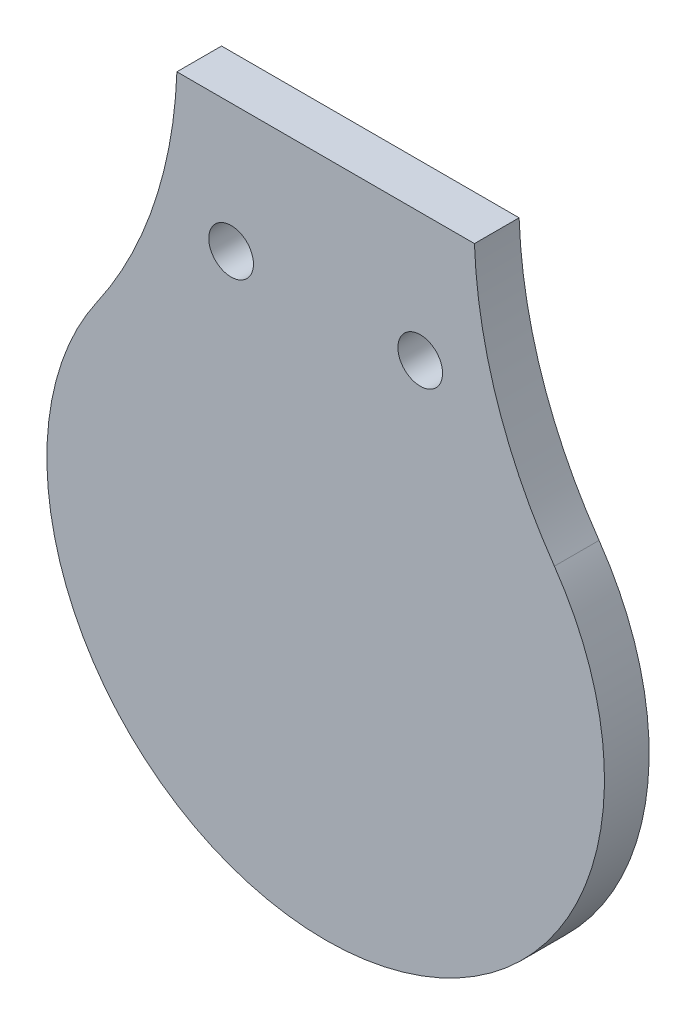
ISO-10303-21;
HEADER;
FILE_DESCRIPTION(('STEP AP214'),'2;1');
FILE_NAME('part.step','',(''),(''),'','','');
FILE_SCHEMA(('AUTOMOTIVE_DESIGN { 1 0 10303 214 1 1 1 1 }'));
ENDSEC;
DATA;
#1=APPLICATION_CONTEXT('core data for automotive mechanical design processes');
#2=APPLICATION_PROTOCOL_DEFINITION('international standard','automotive_design',2000,#1);
#3=PRODUCT_CONTEXT('',#1,'mechanical');
#4=PRODUCT('Part','Part','',(#3));
#5=PRODUCT_RELATED_PRODUCT_CATEGORY('part','',(#4));
#6=PRODUCT_DEFINITION_FORMATION('','',#4);
#7=PRODUCT_DEFINITION_CONTEXT('part definition',#1,'design');
#8=PRODUCT_DEFINITION('design','',#6,#7);
#9=PRODUCT_DEFINITION_SHAPE('','',#8);
#10=(LENGTH_UNIT() NAMED_UNIT(*) SI_UNIT(.MILLI.,.METRE.));
#11=(NAMED_UNIT(*) PLANE_ANGLE_UNIT() SI_UNIT($,.RADIAN.));
#12=(NAMED_UNIT(*) SI_UNIT($,.STERADIAN.) SOLID_ANGLE_UNIT());
#13=UNCERTAINTY_MEASURE_WITH_UNIT(LENGTH_MEASURE(1.E-05),#10,'distance_accuracy_value','');
#14=(GEOMETRIC_REPRESENTATION_CONTEXT(3) GLOBAL_UNCERTAINTY_ASSIGNED_CONTEXT((#13)) GLOBAL_UNIT_ASSIGNED_CONTEXT((#10,
#11,#12)) REPRESENTATION_CONTEXT('',''));
#15=CARTESIAN_POINT('',(0.,0.,0.));
#16=DIRECTION('',(0.,0.,1.));
#17=DIRECTION('',(1.,0.,0.));
#18=AXIS2_PLACEMENT_3D('',#15,#16,#17);
#19=CARTESIAN_POINT('',(67.691,-360.114950628356,5.08));
#20=DIRECTION('',(0.,0.,1.));
#21=DIRECTION('',(1.,0.,0.));
#22=AXIS2_PLACEMENT_3D('',#19,#20,#21);
#23=PLANE('',#22);
#24=CARTESIAN_POINT('',(-10.7564051785917,-376.525575709161,5.08));
#25=DIRECTION('',(0.,0.,1.));
#26=DIRECTION('',(1.,0.,0.));
#27=AXIS2_PLACEMENT_3D('',#24,#25,#26);
#28=CIRCLE('',#27,2.54000000000001);
#29=CARTESIAN_POINT('',(-8.21640517859169,-376.525575709161,5.08));
#30=VERTEX_POINT('',#29);
#31=EDGE_CURVE('E99',#30,#30,#28,.T.);
#32=ORIENTED_EDGE('',*,*,#31,.F.);
#33=EDGE_LOOP('',(#32));
#34=FACE_BOUND('',#33,.T.);
#35=CARTESIAN_POINT('',(67.691,-360.114950628356,5.08));
#36=DIRECTION('',(0.,0.,-1.));
#37=DIRECTION('',(1.,0.,0.));
#38=AXIS2_PLACEMENT_3D('',#35,#36,#37);
#39=CIRCLE('',#38,50.8);
#40=CARTESIAN_POINT('',(26.0165345461141,-389.164544930737,5.08));
#41=VERTEX_POINT('',#40);
#42=CARTESIAN_POINT('',(16.9235329050641,-361.932719800885,5.08));
#43=VERTEX_POINT('',#42);
#44=EDGE_CURVE('E84',#41,#43,#39,.T.);
#45=ORIENTED_EDGE('',*,*,#44,.T.);
#46=DIRECTION('',(-1.,0.,0.));
#47=VECTOR('',#46,1.);
#48=CARTESIAN_POINT('',(-16.923532905064,-361.932719800885,5.08));
#49=LINE('',#48,#47);
#50=CARTESIAN_POINT('',(-16.923532905064,-361.932719800885,5.08));
#51=VERTEX_POINT('',#50);
#52=EDGE_CURVE('E79',#43,#51,#49,.T.);
#53=ORIENTED_EDGE('',*,*,#52,.T.);
#54=CARTESIAN_POINT('',(-67.691,-360.114950628356,5.08));
#55=DIRECTION('',(0.,0.,-1.));
#56=DIRECTION('',(1.,0.,0.));
#57=AXIS2_PLACEMENT_3D('',#54,#55,#56);
#58=CIRCLE('',#57,50.8);
#59=CARTESIAN_POINT('',(-26.0165345461148,-389.164544930736,5.08));
#60=VERTEX_POINT('',#59);
#61=EDGE_CURVE('E82',#51,#60,#58,.T.);
#62=ORIENTED_EDGE('',*,*,#61,.T.);
#63=CARTESIAN_POINT('',(-5.34294830600857E-13,-407.299625140817,5.08));
#64=DIRECTION('',(0.,0.,1.));
#65=DIRECTION('',(1.,0.,0.));
#66=AXIS2_PLACEMENT_3D('',#63,#64,#65);
#67=CIRCLE('',#66,31.7134230888942);
#68=EDGE_CURVE('E49',#60,#41,#67,.T.);
#69=ORIENTED_EDGE('',*,*,#68,.T.);
#70=EDGE_LOOP('',(#45,#53,#62,#69));
#71=FACE_BOUND('',#70,.T.);
#72=CARTESIAN_POINT('',(10.7564051785917,-376.525575709161,5.08));
#73=DIRECTION('',(0.,0.,1.));
#74=DIRECTION('',(1.,0.,0.));
#75=AXIS2_PLACEMENT_3D('',#72,#73,#74);
#76=CIRCLE('',#75,2.53999999999999);
#77=CARTESIAN_POINT('',(13.2964051785917,-376.525575709161,5.08));
#78=VERTEX_POINT('',#77);
#79=EDGE_CURVE('E114',#78,#78,#76,.T.);
#80=ORIENTED_EDGE('',*,*,#79,.F.);
#81=EDGE_LOOP('',(#80));
#82=FACE_BOUND('',#81,.T.);
#83=ADVANCED_FACE('F32',(#34,#71,#82),#23,.T.);
#84=CARTESIAN_POINT('',(67.691,-360.114950628356,0.));
#85=DIRECTION('',(0.,0.,1.));
#86=DIRECTION('',(1.,0.,0.));
#87=AXIS2_PLACEMENT_3D('',#84,#85,#86);
#88=PLANE('',#87);
#89=CARTESIAN_POINT('',(67.691,-360.114950628356,0.));
#90=DIRECTION('',(0.,0.,-1.));
#91=DIRECTION('',(1.,0.,0.));
#92=AXIS2_PLACEMENT_3D('',#89,#90,#91);
#93=CIRCLE('',#92,50.8);
#94=CARTESIAN_POINT('',(26.0165345461141,-389.164544930737,0.));
#95=VERTEX_POINT('',#94);
#96=CARTESIAN_POINT('',(16.9235329050641,-361.932719800885,0.));
#97=VERTEX_POINT('',#96);
#98=EDGE_CURVE('E96',#95,#97,#93,.T.);
#99=ORIENTED_EDGE('',*,*,#98,.F.);
#100=CARTESIAN_POINT('',(-5.34294830600857E-13,-407.299625140817,0.));
#101=DIRECTION('',(0.,0.,1.));
#102=DIRECTION('',(1.,0.,0.));
#103=AXIS2_PLACEMENT_3D('',#100,#101,#102);
#104=CIRCLE('',#103,31.7134230888942);
#105=CARTESIAN_POINT('',(-26.0165345461148,-389.164544930736,0.));
#106=VERTEX_POINT('',#105);
#107=EDGE_CURVE('E72',#106,#95,#104,.T.);
#108=ORIENTED_EDGE('',*,*,#107,.F.);
#109=CARTESIAN_POINT('',(-67.691,-360.114950628356,0.));
#110=DIRECTION('',(0.,0.,-1.));
#111=DIRECTION('',(1.,0.,0.));
#112=AXIS2_PLACEMENT_3D('',#109,#110,#111);
#113=CIRCLE('',#112,50.8);
#114=CARTESIAN_POINT('',(-16.923532905064,-361.932719800885,0.));
#115=VERTEX_POINT('',#114);
#116=EDGE_CURVE('E66',#115,#106,#113,.T.);
#117=ORIENTED_EDGE('',*,*,#116,.F.);
#118=DIRECTION('',(-1.,0.,0.));
#119=VECTOR('',#118,1.);
#120=CARTESIAN_POINT('',(-16.923532905064,-361.932719800885,0.));
#121=LINE('',#120,#119);
#122=EDGE_CURVE('E88',#97,#115,#121,.T.);
#123=ORIENTED_EDGE('',*,*,#122,.F.);
#124=EDGE_LOOP('',(#99,#108,#117,#123));
#125=FACE_BOUND('',#124,.T.);
#126=CARTESIAN_POINT('',(-10.7564051785917,-376.525575709161,0.));
#127=DIRECTION('',(0.,0.,1.));
#128=DIRECTION('',(1.,0.,0.));
#129=AXIS2_PLACEMENT_3D('',#126,#127,#128);
#130=CIRCLE('',#129,2.54000000000001);
#131=CARTESIAN_POINT('',(-8.21640517859169,-376.525575709161,0.));
#132=VERTEX_POINT('',#131);
#133=EDGE_CURVE('E111',#132,#132,#130,.T.);
#134=ORIENTED_EDGE('',*,*,#133,.T.);
#135=EDGE_LOOP('',(#134));
#136=FACE_BOUND('',#135,.T.);
#137=CARTESIAN_POINT('',(10.7564051785917,-376.525575709161,0.));
#138=DIRECTION('',(0.,0.,1.));
#139=DIRECTION('',(1.,0.,0.));
#140=AXIS2_PLACEMENT_3D('',#137,#138,#139);
#141=CIRCLE('',#140,2.53999999999999);
#142=CARTESIAN_POINT('',(13.2964051785917,-376.525575709161,0.));
#143=VERTEX_POINT('',#142);
#144=EDGE_CURVE('E117',#143,#143,#141,.T.);
#145=ORIENTED_EDGE('',*,*,#144,.T.);
#146=EDGE_LOOP('',(#145));
#147=FACE_BOUND('',#146,.T.);
#148=ADVANCED_FACE('F107',(#125,#136,#147),#88,.F.);
#149=CARTESIAN_POINT('',(67.691,-360.114950628356,5.08));
#150=DIRECTION('',(0.,0.,-1.));
#151=DIRECTION('',(-1.,0.,0.));
#152=AXIS2_PLACEMENT_3D('',#149,#150,#151);
#153=CYLINDRICAL_SURFACE('',#152,50.8);
#154=ORIENTED_EDGE('',*,*,#98,.T.);
#155=DIRECTION('',(0.,0.,-1.));
#156=VECTOR('',#155,1.);
#157=CARTESIAN_POINT('',(16.9235329050641,-361.932719800885,5.08));
#158=LINE('',#157,#156);
#159=EDGE_CURVE('E11',#43,#97,#158,.T.);
#160=ORIENTED_EDGE('',*,*,#159,.F.);
#161=ORIENTED_EDGE('',*,*,#44,.F.);
#162=DIRECTION('',(0.,0.,-1.));
#163=VECTOR('',#162,1.);
#164=CARTESIAN_POINT('',(26.0165345461141,-389.164544930737,5.08));
#165=LINE('',#164,#163);
#166=EDGE_CURVE('E92',#41,#95,#165,.T.);
#167=ORIENTED_EDGE('',*,*,#166,.T.);
#168=EDGE_LOOP('',(#154,#160,#161,#167));
#169=FACE_BOUND('',#168,.T.);
#170=ADVANCED_FACE('F34',(#169),#153,.F.);
#171=CARTESIAN_POINT('',(-16.923532905064,-361.932719800885,5.08));
#172=DIRECTION('',(0.,-1.,0.));
#173=DIRECTION('',(0.,0.,-1.));
#174=AXIS2_PLACEMENT_3D('',#171,#172,#173);
#175=PLANE('',#174);
#176=ORIENTED_EDGE('',*,*,#122,.T.);
#177=DIRECTION('',(0.,0.,-1.));
#178=VECTOR('',#177,1.);
#179=CARTESIAN_POINT('',(-16.923532905064,-361.932719800885,5.08));
#180=LINE('',#179,#178);
#181=EDGE_CURVE('E41',#51,#115,#180,.T.);
#182=ORIENTED_EDGE('',*,*,#181,.F.);
#183=ORIENTED_EDGE('',*,*,#52,.F.);
#184=ORIENTED_EDGE('',*,*,#159,.T.);
#185=EDGE_LOOP('',(#176,#182,#183,#184));
#186=FACE_BOUND('',#185,.T.);
#187=ADVANCED_FACE('F87',(#186),#175,.F.);
#188=CARTESIAN_POINT('',(-67.691,-360.114950628356,5.08));
#189=DIRECTION('',(0.,0.,-1.));
#190=DIRECTION('',(-1.,0.,0.));
#191=AXIS2_PLACEMENT_3D('',#188,#189,#190);
#192=CYLINDRICAL_SURFACE('',#191,50.8);
#193=ORIENTED_EDGE('',*,*,#116,.T.);
#194=DIRECTION('',(0.,0.,-1.));
#195=VECTOR('',#194,1.);
#196=CARTESIAN_POINT('',(-26.0165345461148,-389.164544930736,5.08));
#197=LINE('',#196,#195);
#198=EDGE_CURVE('E89',#60,#106,#197,.T.);
#199=ORIENTED_EDGE('',*,*,#198,.F.);
#200=ORIENTED_EDGE('',*,*,#61,.F.);
#201=ORIENTED_EDGE('',*,*,#181,.T.);
#202=EDGE_LOOP('',(#193,#199,#200,#201));
#203=FACE_BOUND('',#202,.T.);
#204=ADVANCED_FACE('F90',(#203),#192,.F.);
#205=CARTESIAN_POINT('',(-5.34294830600857E-13,-407.299625140817,5.08));
#206=DIRECTION('',(0.,0.,-1.));
#207=DIRECTION('',(-1.,0.,0.));
#208=AXIS2_PLACEMENT_3D('',#205,#206,#207);
#209=CYLINDRICAL_SURFACE('',#208,31.7134230888942);
#210=ORIENTED_EDGE('',*,*,#107,.T.);
#211=ORIENTED_EDGE('',*,*,#166,.F.);
#212=ORIENTED_EDGE('',*,*,#68,.F.);
#213=ORIENTED_EDGE('',*,*,#198,.T.);
#214=EDGE_LOOP('',(#210,#211,#212,#213));
#215=FACE_BOUND('',#214,.T.);
#216=ADVANCED_FACE('F104',(#215),#209,.T.);
#217=CARTESIAN_POINT('',(-10.7564051785917,-376.525575709161,5.08));
#218=DIRECTION('',(0.,0.,-1.));
#219=DIRECTION('',(-1.,0.,0.));
#220=AXIS2_PLACEMENT_3D('',#217,#218,#219);
#221=CYLINDRICAL_SURFACE('',#220,2.54000000000001);
#222=ORIENTED_EDGE('',*,*,#31,.T.);
#223=EDGE_LOOP('',(#222));
#224=FACE_BOUND('',#223,.T.);
#225=ORIENTED_EDGE('',*,*,#133,.F.);
#226=EDGE_LOOP('',(#225));
#227=FACE_BOUND('',#226,.T.);
#228=ADVANCED_FACE('F134',(#224,#227),#221,.F.);
#229=CARTESIAN_POINT('',(10.7564051785917,-376.525575709161,5.08));
#230=DIRECTION('',(0.,0.,-1.));
#231=DIRECTION('',(-1.,0.,0.));
#232=AXIS2_PLACEMENT_3D('',#229,#230,#231);
#233=CYLINDRICAL_SURFACE('',#232,2.53999999999999);
#234=ORIENTED_EDGE('',*,*,#79,.T.);
#235=EDGE_LOOP('',(#234));
#236=FACE_BOUND('',#235,.T.);
#237=ORIENTED_EDGE('',*,*,#144,.F.);
#238=EDGE_LOOP('',(#237));
#239=FACE_BOUND('',#238,.T.);
#240=ADVANCED_FACE('F123',(#236,#239),#233,.F.);
#241=CLOSED_SHELL('',(#83,#148,#170,#187,#204,#216,#228,#240));
#242=MANIFOLD_SOLID_BREP('B2',#241);
#243=ADVANCED_BREP_SHAPE_REPRESENTATION('',(#18,#242),#14);
#244=SHAPE_DEFINITION_REPRESENTATION(#9,#243);
ENDSEC;
END-ISO-10303-21;
